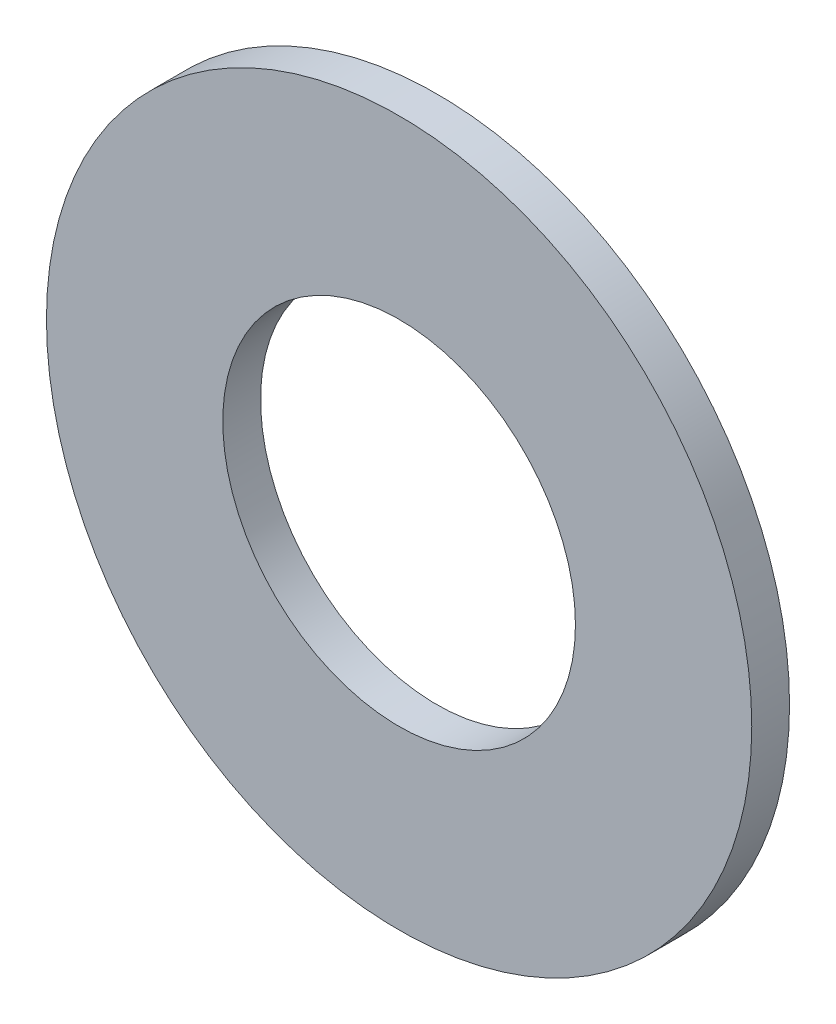
ISO-10303-21;
HEADER;
FILE_DESCRIPTION(('STEP AP214'),'2;1');
FILE_NAME('part.step','',(''),(''),'','','');
FILE_SCHEMA(('AUTOMOTIVE_DESIGN { 1 0 10303 214 1 1 1 1 }'));
ENDSEC;
DATA;
#1=APPLICATION_CONTEXT('core data for automotive mechanical design processes');
#2=APPLICATION_PROTOCOL_DEFINITION('international standard','automotive_design',2000,#1);
#3=PRODUCT_CONTEXT('',#1,'mechanical');
#4=PRODUCT('Part','Part','',(#3));
#5=PRODUCT_RELATED_PRODUCT_CATEGORY('part','',(#4));
#6=PRODUCT_DEFINITION_FORMATION('','',#4);
#7=PRODUCT_DEFINITION_CONTEXT('part definition',#1,'design');
#8=PRODUCT_DEFINITION('design','',#6,#7);
#9=PRODUCT_DEFINITION_SHAPE('','',#8);
#10=(LENGTH_UNIT() NAMED_UNIT(*) SI_UNIT(.MILLI.,.METRE.));
#11=(NAMED_UNIT(*) PLANE_ANGLE_UNIT() SI_UNIT($,.RADIAN.));
#12=(NAMED_UNIT(*) SI_UNIT($,.STERADIAN.) SOLID_ANGLE_UNIT());
#13=UNCERTAINTY_MEASURE_WITH_UNIT(LENGTH_MEASURE(1.E-05),#10,'distance_accuracy_value','');
#14=(GEOMETRIC_REPRESENTATION_CONTEXT(3) GLOBAL_UNCERTAINTY_ASSIGNED_CONTEXT((#13)) GLOBAL_UNIT_ASSIGNED_CONTEXT((#10,
#11,#12)) REPRESENTATION_CONTEXT('',''));
#15=CARTESIAN_POINT('',(0.,0.,0.));
#16=DIRECTION('',(0.,0.,1.));
#17=DIRECTION('',(1.,0.,0.));
#18=AXIS2_PLACEMENT_3D('',#15,#16,#17);
#19=CARTESIAN_POINT('',(0.,0.,1.5));
#20=DIRECTION('',(0.,0.,1.));
#21=DIRECTION('',(1.,0.,0.));
#22=AXIS2_PLACEMENT_3D('',#19,#20,#21);
#23=PLANE('',#22);
#24=CARTESIAN_POINT('',(0.,0.,1.5));
#25=DIRECTION('',(0.,0.,1.));
#26=DIRECTION('',(1.,0.,0.));
#27=AXIS2_PLACEMENT_3D('',#24,#25,#26);
#28=CIRCLE('',#27,14.);
#29=CARTESIAN_POINT('',(14.,0.,1.5));
#30=VERTEX_POINT('',#29);
#31=EDGE_CURVE('E10',#30,#30,#28,.T.);
#32=ORIENTED_EDGE('',*,*,#31,.T.);
#33=EDGE_LOOP('',(#32));
#34=FACE_BOUND('',#33,.T.);
#35=CARTESIAN_POINT('',(0.,0.,1.5));
#36=DIRECTION('',(0.,0.,1.));
#37=DIRECTION('',(1.,0.,0.));
#38=AXIS2_PLACEMENT_3D('',#35,#36,#37);
#39=CIRCLE('',#38,7.);
#40=CARTESIAN_POINT('',(7.,0.,1.5));
#41=VERTEX_POINT('',#40);
#42=EDGE_CURVE('E50',#41,#41,#39,.T.);
#43=ORIENTED_EDGE('',*,*,#42,.F.);
#44=EDGE_LOOP('',(#43));
#45=FACE_BOUND('',#44,.T.);
#46=ADVANCED_FACE('F37',(#34,#45),#23,.T.);
#47=CARTESIAN_POINT('',(0.,0.,0.));
#48=DIRECTION('',(0.,0.,1.));
#49=DIRECTION('',(1.,0.,0.));
#50=AXIS2_PLACEMENT_3D('',#47,#48,#49);
#51=PLANE('',#50);
#52=CARTESIAN_POINT('',(0.,0.,0.));
#53=DIRECTION('',(0.,0.,1.));
#54=DIRECTION('',(1.,0.,0.));
#55=AXIS2_PLACEMENT_3D('',#52,#53,#54);
#56=CIRCLE('',#55,14.);
#57=CARTESIAN_POINT('',(14.,0.,0.));
#58=VERTEX_POINT('',#57);
#59=EDGE_CURVE('E41',#58,#58,#56,.T.);
#60=ORIENTED_EDGE('',*,*,#59,.F.);
#61=EDGE_LOOP('',(#60));
#62=FACE_BOUND('',#61,.T.);
#63=CARTESIAN_POINT('',(0.,0.,0.));
#64=DIRECTION('',(0.,0.,1.));
#65=DIRECTION('',(1.,0.,0.));
#66=AXIS2_PLACEMENT_3D('',#63,#64,#65);
#67=CIRCLE('',#66,7.);
#68=CARTESIAN_POINT('',(7.,0.,0.));
#69=VERTEX_POINT('',#68);
#70=EDGE_CURVE('E52',#69,#69,#67,.T.);
#71=ORIENTED_EDGE('',*,*,#70,.T.);
#72=EDGE_LOOP('',(#71));
#73=FACE_BOUND('',#72,.T.);
#74=ADVANCED_FACE('F64',(#62,#73),#51,.F.);
#75=CARTESIAN_POINT('',(0.,0.,1.5));
#76=DIRECTION('',(0.,0.,-1.));
#77=DIRECTION('',(-1.,0.,0.));
#78=AXIS2_PLACEMENT_3D('',#75,#76,#77);
#79=CYLINDRICAL_SURFACE('',#78,14.);
#80=ORIENTED_EDGE('',*,*,#31,.F.);
#81=EDGE_LOOP('',(#80));
#82=FACE_BOUND('',#81,.T.);
#83=ORIENTED_EDGE('',*,*,#59,.T.);
#84=EDGE_LOOP('',(#83));
#85=FACE_BOUND('',#84,.T.);
#86=ADVANCED_FACE('F39',(#82,#85),#79,.T.);
#87=CARTESIAN_POINT('',(0.,0.,1.5));
#88=DIRECTION('',(0.,0.,-1.));
#89=DIRECTION('',(-1.,0.,0.));
#90=AXIS2_PLACEMENT_3D('',#87,#88,#89);
#91=CYLINDRICAL_SURFACE('',#90,7.);
#92=ORIENTED_EDGE('',*,*,#42,.T.);
#93=EDGE_LOOP('',(#92));
#94=FACE_BOUND('',#93,.T.);
#95=ORIENTED_EDGE('',*,*,#70,.F.);
#96=EDGE_LOOP('',(#95));
#97=FACE_BOUND('',#96,.T.);
#98=ADVANCED_FACE('F60',(#94,#97),#91,.F.);
#99=CLOSED_SHELL('',(#46,#74,#86,#98));
#100=MANIFOLD_SOLID_BREP('B2',#99);
#101=ADVANCED_BREP_SHAPE_REPRESENTATION('',(#18,#100),#14);
#102=SHAPE_DEFINITION_REPRESENTATION(#9,#101);
ENDSEC;
END-ISO-10303-21;
